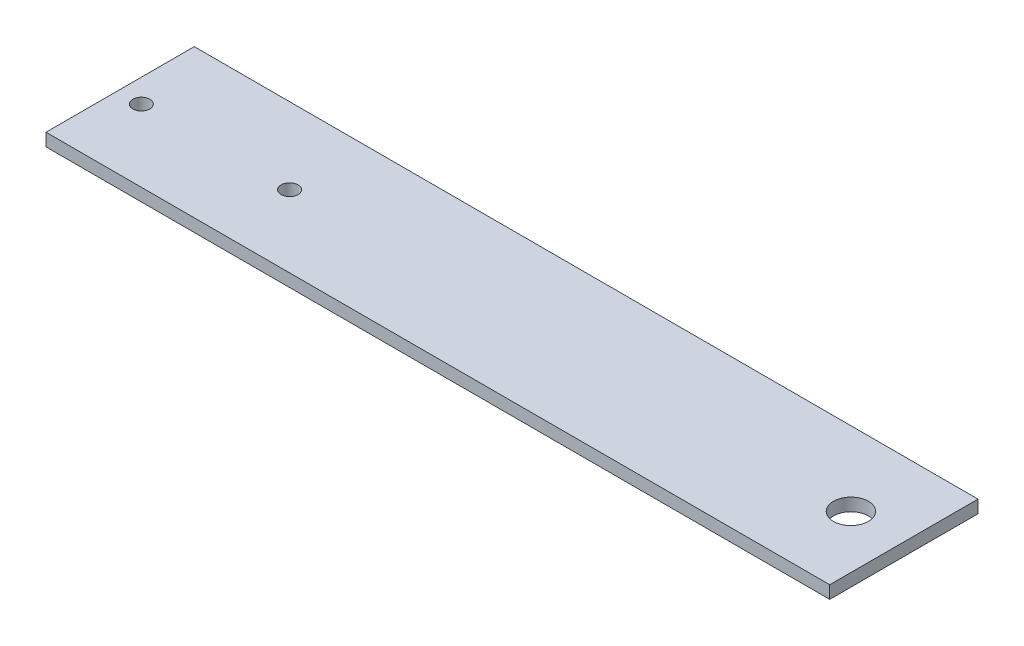
ISO-10303-21;
HEADER;
FILE_DESCRIPTION(('STEP AP214'),'2;1');
FILE_NAME('part.step','',(''),(''),'','','');
FILE_SCHEMA(('AUTOMOTIVE_DESIGN { 1 0 10303 214 1 1 1 1 }'));
ENDSEC;
DATA;
#1=APPLICATION_CONTEXT('core data for automotive mechanical design processes');
#2=APPLICATION_PROTOCOL_DEFINITION('international standard','automotive_design',2000,#1);
#3=PRODUCT_CONTEXT('',#1,'mechanical');
#4=PRODUCT('Part','Part','',(#3));
#5=PRODUCT_RELATED_PRODUCT_CATEGORY('part','',(#4));
#6=PRODUCT_DEFINITION_FORMATION('','',#4);
#7=PRODUCT_DEFINITION_CONTEXT('part definition',#1,'design');
#8=PRODUCT_DEFINITION('design','',#6,#7);
#9=PRODUCT_DEFINITION_SHAPE('','',#8);
#10=(LENGTH_UNIT() NAMED_UNIT(*) SI_UNIT(.MILLI.,.METRE.));
#11=(NAMED_UNIT(*) PLANE_ANGLE_UNIT() SI_UNIT($,.RADIAN.));
#12=(NAMED_UNIT(*) SI_UNIT($,.STERADIAN.) SOLID_ANGLE_UNIT());
#13=UNCERTAINTY_MEASURE_WITH_UNIT(LENGTH_MEASURE(1.E-05),#10,'distance_accuracy_value','');
#14=(GEOMETRIC_REPRESENTATION_CONTEXT(3) GLOBAL_UNCERTAINTY_ASSIGNED_CONTEXT((#13)) GLOBAL_UNIT_ASSIGNED_CONTEXT((#10,
#11,#12)) REPRESENTATION_CONTEXT('',''));
#15=CARTESIAN_POINT('',(0.,0.,0.));
#16=DIRECTION('',(0.,0.,1.));
#17=DIRECTION('',(1.,0.,0.));
#18=AXIS2_PLACEMENT_3D('',#15,#16,#17);
#19=CARTESIAN_POINT('',(0.,0.,0.));
#20=DIRECTION('',(0.,1.,0.));
#21=DIRECTION('',(0.,0.,1.));
#22=AXIS2_PLACEMENT_3D('',#19,#20,#21);
#23=PLANE('',#22);
#24=DIRECTION('',(0.,0.,1.));
#25=VECTOR('',#24,1.);
#26=CARTESIAN_POINT('',(-92.5,0.,0.));
#27=LINE('',#26,#25);
#28=CARTESIAN_POINT('',(-92.5,0.,-17.5));
#29=VERTEX_POINT('',#28);
#30=CARTESIAN_POINT('',(-92.5,0.,17.5));
#31=VERTEX_POINT('',#30);
#32=EDGE_CURVE('E130',#29,#31,#27,.T.);
#33=ORIENTED_EDGE('',*,*,#32,.F.);
#34=DIRECTION('',(1.,0.,0.));
#35=VECTOR('',#34,1.);
#36=CARTESIAN_POINT('',(0.,0.,-17.5));
#37=LINE('',#36,#35);
#38=CARTESIAN_POINT('',(92.5,0.,-17.5));
#39=VERTEX_POINT('',#38);
#40=EDGE_CURVE('E139',#29,#39,#37,.T.);
#41=ORIENTED_EDGE('',*,*,#40,.T.);
#42=DIRECTION('',(0.,0.,1.));
#43=VECTOR('',#42,1.);
#44=CARTESIAN_POINT('',(92.5,0.,0.));
#45=LINE('',#44,#43);
#46=CARTESIAN_POINT('',(92.5,0.,17.5));
#47=VERTEX_POINT('',#46);
#48=EDGE_CURVE('E136',#39,#47,#45,.T.);
#49=ORIENTED_EDGE('',*,*,#48,.T.);
#50=DIRECTION('',(1.,0.,0.));
#51=VECTOR('',#50,1.);
#52=CARTESIAN_POINT('',(0.,0.,17.5));
#53=LINE('',#52,#51);
#54=EDGE_CURVE('E114',#31,#47,#53,.T.);
#55=ORIENTED_EDGE('',*,*,#54,.F.);
#56=EDGE_LOOP('',(#33,#41,#49,#55));
#57=FACE_BOUND('',#56,.T.);
#58=CARTESIAN_POINT('',(80.,0.,0.));
#59=DIRECTION('',(0.,1.,0.));
#60=DIRECTION('',(0.,0.,1.));
#61=AXIS2_PLACEMENT_3D('',#58,#59,#60);
#62=CIRCLE('',#61,4.125);
#63=CARTESIAN_POINT('',(80.,0.,4.125));
#64=VERTEX_POINT('',#63);
#65=EDGE_CURVE('E126',#64,#64,#62,.T.);
#66=ORIENTED_EDGE('',*,*,#65,.T.);
#67=EDGE_LOOP('',(#66));
#68=FACE_BOUND('',#67,.T.);
#69=CARTESIAN_POINT('',(-52.,0.,0.499999999999997));
#70=DIRECTION('',(0.,-1.,0.));
#71=DIRECTION('',(0.,0.,-1.));
#72=AXIS2_PLACEMENT_3D('',#69,#70,#71);
#73=CIRCLE('',#72,2.);
#74=CARTESIAN_POINT('',(-52.,0.,-1.5));
#75=VERTEX_POINT('',#74);
#76=EDGE_CURVE('E155',#75,#75,#73,.T.);
#77=ORIENTED_EDGE('',*,*,#76,.F.);
#78=EDGE_LOOP('',(#77));
#79=FACE_BOUND('',#78,.T.);
#80=CARTESIAN_POINT('',(-87.,0.,0.500000000000001));
#81=DIRECTION('',(0.,1.,0.));
#82=DIRECTION('',(0.,0.,1.));
#83=AXIS2_PLACEMENT_3D('',#80,#81,#82);
#84=CIRCLE('',#83,2.);
#85=CARTESIAN_POINT('',(-87.,0.,2.5));
#86=VERTEX_POINT('',#85);
#87=EDGE_CURVE('E131',#86,#86,#84,.T.);
#88=ORIENTED_EDGE('',*,*,#87,.T.);
#89=EDGE_LOOP('',(#88));
#90=FACE_BOUND('',#89,.T.);
#91=ADVANCED_FACE('F56',(#57,#68,#79,#90),#23,.F.);
#92=CARTESIAN_POINT('',(0.,3.,0.));
#93=DIRECTION('',(0.,1.,0.));
#94=DIRECTION('',(0.,0.,1.));
#95=AXIS2_PLACEMENT_3D('',#92,#93,#94);
#96=PLANE('',#95);
#97=CARTESIAN_POINT('',(-52.,3.,0.499999999999997));
#98=DIRECTION('',(0.,-1.,0.));
#99=DIRECTION('',(0.,0.,-1.));
#100=AXIS2_PLACEMENT_3D('',#97,#98,#99);
#101=CIRCLE('',#100,2.);
#102=CARTESIAN_POINT('',(-52.,3.,-1.5));
#103=VERTEX_POINT('',#102);
#104=EDGE_CURVE('E159',#103,#103,#101,.T.);
#105=ORIENTED_EDGE('',*,*,#104,.T.);
#106=EDGE_LOOP('',(#105));
#107=FACE_BOUND('',#106,.T.);
#108=CARTESIAN_POINT('',(80.,3.,0.));
#109=DIRECTION('',(0.,1.,0.));
#110=DIRECTION('',(0.,0.,1.));
#111=AXIS2_PLACEMENT_3D('',#108,#109,#110);
#112=CIRCLE('',#111,4.125);
#113=CARTESIAN_POINT('',(80.,3.,4.125));
#114=VERTEX_POINT('',#113);
#115=EDGE_CURVE('E143',#114,#114,#112,.T.);
#116=ORIENTED_EDGE('',*,*,#115,.F.);
#117=EDGE_LOOP('',(#116));
#118=FACE_BOUND('',#117,.T.);
#119=DIRECTION('',(0.,0.,1.));
#120=VECTOR('',#119,1.);
#121=CARTESIAN_POINT('',(-92.5,3.,0.));
#122=LINE('',#121,#120);
#123=CARTESIAN_POINT('',(-92.5,3.,-17.5));
#124=VERTEX_POINT('',#123);
#125=CARTESIAN_POINT('',(-92.5,3.,17.5));
#126=VERTEX_POINT('',#125);
#127=EDGE_CURVE('E108',#124,#126,#122,.T.);
#128=ORIENTED_EDGE('',*,*,#127,.T.);
#129=DIRECTION('',(1.,0.,0.));
#130=VECTOR('',#129,1.);
#131=CARTESIAN_POINT('',(0.,3.,17.5));
#132=LINE('',#131,#130);
#133=CARTESIAN_POINT('',(92.5,3.,17.5));
#134=VERTEX_POINT('',#133);
#135=EDGE_CURVE('E99',#126,#134,#132,.T.);
#136=ORIENTED_EDGE('',*,*,#135,.T.);
#137=DIRECTION('',(0.,0.,1.));
#138=VECTOR('',#137,1.);
#139=CARTESIAN_POINT('',(92.5,3.,0.));
#140=LINE('',#139,#138);
#141=CARTESIAN_POINT('',(92.5,3.,-17.5));
#142=VERTEX_POINT('',#141);
#143=EDGE_CURVE('E107',#142,#134,#140,.T.);
#144=ORIENTED_EDGE('',*,*,#143,.F.);
#145=DIRECTION('',(1.,0.,0.));
#146=VECTOR('',#145,1.);
#147=CARTESIAN_POINT('',(0.,3.,-17.5));
#148=LINE('',#147,#146);
#149=EDGE_CURVE('E120',#124,#142,#148,.T.);
#150=ORIENTED_EDGE('',*,*,#149,.F.);
#151=EDGE_LOOP('',(#128,#136,#144,#150));
#152=FACE_BOUND('',#151,.T.);
#153=CARTESIAN_POINT('',(-87.,3.,0.500000000000001));
#154=DIRECTION('',(0.,1.,0.));
#155=DIRECTION('',(0.,0.,1.));
#156=AXIS2_PLACEMENT_3D('',#153,#154,#155);
#157=CIRCLE('',#156,2.);
#158=CARTESIAN_POINT('',(-87.,3.,2.5));
#159=VERTEX_POINT('',#158);
#160=EDGE_CURVE('E163',#159,#159,#157,.T.);
#161=ORIENTED_EDGE('',*,*,#160,.F.);
#162=EDGE_LOOP('',(#161));
#163=FACE_BOUND('',#162,.T.);
#164=ADVANCED_FACE('F103',(#107,#118,#152,#163),#96,.T.);
#165=CARTESIAN_POINT('',(0.,3.,17.5));
#166=DIRECTION('',(0.,0.,-1.));
#167=DIRECTION('',(-1.,0.,0.));
#168=AXIS2_PLACEMENT_3D('',#165,#166,#167);
#169=PLANE('',#168);
#170=ORIENTED_EDGE('',*,*,#54,.T.);
#171=DIRECTION('',(0.,-1.,0.));
#172=VECTOR('',#171,1.);
#173=CARTESIAN_POINT('',(92.5,3.,17.5));
#174=LINE('',#173,#172);
#175=EDGE_CURVE('E66',#134,#47,#174,.T.);
#176=ORIENTED_EDGE('',*,*,#175,.F.);
#177=ORIENTED_EDGE('',*,*,#135,.F.);
#178=DIRECTION('',(0.,-1.,0.));
#179=VECTOR('',#178,1.);
#180=CARTESIAN_POINT('',(-92.5,3.,17.5));
#181=LINE('',#180,#179);
#182=EDGE_CURVE('E12',#126,#31,#181,.T.);
#183=ORIENTED_EDGE('',*,*,#182,.T.);
#184=EDGE_LOOP('',(#170,#176,#177,#183));
#185=FACE_BOUND('',#184,.T.);
#186=ADVANCED_FACE('F113',(#185),#169,.F.);
#187=CARTESIAN_POINT('',(92.5,3.,0.));
#188=DIRECTION('',(1.,0.,0.));
#189=DIRECTION('',(0.,0.,-1.));
#190=AXIS2_PLACEMENT_3D('',#187,#188,#189);
#191=PLANE('',#190);
#192=ORIENTED_EDGE('',*,*,#48,.F.);
#193=DIRECTION('',(0.,-1.,0.));
#194=VECTOR('',#193,1.);
#195=CARTESIAN_POINT('',(92.5,3.,-17.5));
#196=LINE('',#195,#194);
#197=EDGE_CURVE('E88',#142,#39,#196,.T.);
#198=ORIENTED_EDGE('',*,*,#197,.F.);
#199=ORIENTED_EDGE('',*,*,#143,.T.);
#200=ORIENTED_EDGE('',*,*,#175,.T.);
#201=EDGE_LOOP('',(#192,#198,#199,#200));
#202=FACE_BOUND('',#201,.T.);
#203=ADVANCED_FACE('F118',(#202),#191,.T.);
#204=CARTESIAN_POINT('',(0.,3.,-17.5));
#205=DIRECTION('',(0.,0.,-1.));
#206=DIRECTION('',(-1.,0.,0.));
#207=AXIS2_PLACEMENT_3D('',#204,#205,#206);
#208=PLANE('',#207);
#209=ORIENTED_EDGE('',*,*,#40,.F.);
#210=DIRECTION('',(0.,-1.,0.));
#211=VECTOR('',#210,1.);
#212=CARTESIAN_POINT('',(-92.5,3.,-17.5));
#213=LINE('',#212,#211);
#214=EDGE_CURVE('E74',#124,#29,#213,.T.);
#215=ORIENTED_EDGE('',*,*,#214,.F.);
#216=ORIENTED_EDGE('',*,*,#149,.T.);
#217=ORIENTED_EDGE('',*,*,#197,.T.);
#218=EDGE_LOOP('',(#209,#215,#216,#217));
#219=FACE_BOUND('',#218,.T.);
#220=ADVANCED_FACE('F190',(#219),#208,.T.);
#221=CARTESIAN_POINT('',(-92.5,3.,0.));
#222=DIRECTION('',(1.,0.,0.));
#223=DIRECTION('',(0.,0.,-1.));
#224=AXIS2_PLACEMENT_3D('',#221,#222,#223);
#225=PLANE('',#224);
#226=ORIENTED_EDGE('',*,*,#32,.T.);
#227=ORIENTED_EDGE('',*,*,#182,.F.);
#228=ORIENTED_EDGE('',*,*,#127,.F.);
#229=ORIENTED_EDGE('',*,*,#214,.T.);
#230=EDGE_LOOP('',(#226,#227,#228,#229));
#231=FACE_BOUND('',#230,.T.);
#232=ADVANCED_FACE('F193',(#231),#225,.F.);
#233=CARTESIAN_POINT('',(80.,3.,0.));
#234=DIRECTION('',(0.,-1.,0.));
#235=DIRECTION('',(0.,0.,-1.));
#236=AXIS2_PLACEMENT_3D('',#233,#234,#235);
#237=CYLINDRICAL_SURFACE('',#236,4.125);
#238=ORIENTED_EDGE('',*,*,#115,.T.);
#239=EDGE_LOOP('',(#238));
#240=FACE_BOUND('',#239,.T.);
#241=ORIENTED_EDGE('',*,*,#65,.F.);
#242=EDGE_LOOP('',(#241));
#243=FACE_BOUND('',#242,.T.);
#244=ADVANCED_FACE('F58',(#240,#243),#237,.F.);
#245=CARTESIAN_POINT('',(-52.,0.,0.499999999999997));
#246=DIRECTION('',(0.,1.,0.));
#247=DIRECTION('',(0.,0.,1.));
#248=AXIS2_PLACEMENT_3D('',#245,#246,#247);
#249=CYLINDRICAL_SURFACE('',#248,2.);
#250=ORIENTED_EDGE('',*,*,#76,.T.);
#251=EDGE_LOOP('',(#250));
#252=FACE_BOUND('',#251,.T.);
#253=ORIENTED_EDGE('',*,*,#104,.F.);
#254=EDGE_LOOP('',(#253));
#255=FACE_BOUND('',#254,.T.);
#256=ADVANCED_FACE('F175',(#252,#255),#249,.F.);
#257=CARTESIAN_POINT('',(-87.,0.,0.500000000000001));
#258=DIRECTION('',(0.,1.,0.));
#259=DIRECTION('',(0.,0.,1.));
#260=AXIS2_PLACEMENT_3D('',#257,#258,#259);
#261=CYLINDRICAL_SURFACE('',#260,2.);
#262=ORIENTED_EDGE('',*,*,#87,.F.);
#263=EDGE_LOOP('',(#262));
#264=FACE_BOUND('',#263,.T.);
#265=ORIENTED_EDGE('',*,*,#160,.T.);
#266=EDGE_LOOP('',(#265));
#267=FACE_BOUND('',#266,.T.);
#268=ADVANCED_FACE('F172',(#264,#267),#261,.F.);
#269=CLOSED_SHELL('',(#91,#164,#186,#203,#220,#232,#244,#256,#268));
#270=MANIFOLD_SOLID_BREP('B2',#269);
#271=ADVANCED_BREP_SHAPE_REPRESENTATION('',(#18,#270),#14);
#272=SHAPE_DEFINITION_REPRESENTATION(#9,#271);
ENDSEC;
END-ISO-10303-21;
